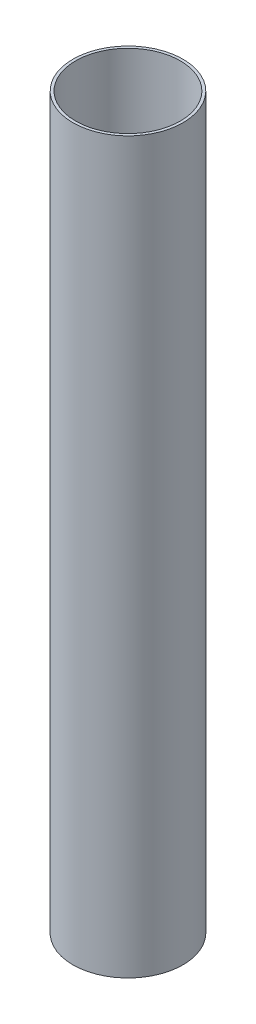
ISO-10303-21;
HEADER;
FILE_DESCRIPTION(('STEP AP214'),'2;1');
FILE_NAME('part.step','',(''),(''),'','','');
FILE_SCHEMA(('AUTOMOTIVE_DESIGN { 1 0 10303 214 1 1 1 1 }'));
ENDSEC;
DATA;
#1=APPLICATION_CONTEXT('core data for automotive mechanical design processes');
#2=APPLICATION_PROTOCOL_DEFINITION('international standard','automotive_design',2000,#1);
#3=PRODUCT_CONTEXT('',#1,'mechanical');
#4=PRODUCT('Part','Part','',(#3));
#5=PRODUCT_RELATED_PRODUCT_CATEGORY('part','',(#4));
#6=PRODUCT_DEFINITION_FORMATION('','',#4);
#7=PRODUCT_DEFINITION_CONTEXT('part definition',#1,'design');
#8=PRODUCT_DEFINITION('design','',#6,#7);
#9=PRODUCT_DEFINITION_SHAPE('','',#8);
#10=(LENGTH_UNIT() NAMED_UNIT(*) SI_UNIT(.MILLI.,.METRE.));
#11=(NAMED_UNIT(*) PLANE_ANGLE_UNIT() SI_UNIT($,.RADIAN.));
#12=(NAMED_UNIT(*) SI_UNIT($,.STERADIAN.) SOLID_ANGLE_UNIT());
#13=UNCERTAINTY_MEASURE_WITH_UNIT(LENGTH_MEASURE(1.E-05),#10,'distance_accuracy_value','');
#14=(GEOMETRIC_REPRESENTATION_CONTEXT(3) GLOBAL_UNCERTAINTY_ASSIGNED_CONTEXT((#13)) GLOBAL_UNIT_ASSIGNED_CONTEXT((#10,
#11,#12)) REPRESENTATION_CONTEXT('',''));
#15=CARTESIAN_POINT('',(0.,0.,0.));
#16=DIRECTION('',(0.,0.,1.));
#17=DIRECTION('',(1.,0.,0.));
#18=AXIS2_PLACEMENT_3D('',#15,#16,#17);
#19=CARTESIAN_POINT('',(0.,265.,0.));
#20=DIRECTION('',(0.,1.,0.));
#21=DIRECTION('',(0.,0.,1.));
#22=AXIS2_PLACEMENT_3D('',#19,#20,#21);
#23=PLANE('',#22);
#24=CARTESIAN_POINT('',(0.,265.,0.));
#25=DIRECTION('',(0.,1.,0.));
#26=DIRECTION('',(0.,0.,1.));
#27=AXIS2_PLACEMENT_3D('',#24,#25,#26);
#28=CIRCLE('',#27,20.);
#29=CARTESIAN_POINT('',(0.,265.,20.));
#30=VERTEX_POINT('',#29);
#31=EDGE_CURVE('E10',#30,#30,#28,.T.);
#32=ORIENTED_EDGE('',*,*,#31,.T.);
#33=EDGE_LOOP('',(#32));
#34=FACE_BOUND('',#33,.T.);
#35=CARTESIAN_POINT('',(0.,265.,0.));
#36=DIRECTION('',(0.,1.,0.));
#37=DIRECTION('',(0.,0.,1.));
#38=AXIS2_PLACEMENT_3D('',#35,#36,#37);
#39=CIRCLE('',#38,19.);
#40=CARTESIAN_POINT('',(0.,265.,19.));
#41=VERTEX_POINT('',#40);
#42=EDGE_CURVE('E43',#41,#41,#39,.T.);
#43=ORIENTED_EDGE('',*,*,#42,.F.);
#44=EDGE_LOOP('',(#43));
#45=FACE_BOUND('',#44,.T.);
#46=ADVANCED_FACE('F32',(#34,#45),#23,.T.);
#47=CARTESIAN_POINT('',(0.,0.,0.));
#48=DIRECTION('',(0.,1.,0.));
#49=DIRECTION('',(0.,0.,1.));
#50=AXIS2_PLACEMENT_3D('',#47,#48,#49);
#51=PLANE('',#50);
#52=CARTESIAN_POINT('',(0.,0.,0.));
#53=DIRECTION('',(0.,1.,0.));
#54=DIRECTION('',(0.,0.,1.));
#55=AXIS2_PLACEMENT_3D('',#52,#53,#54);
#56=CIRCLE('',#55,20.);
#57=CARTESIAN_POINT('',(0.,0.,20.));
#58=VERTEX_POINT('',#57);
#59=EDGE_CURVE('E36',#58,#58,#56,.T.);
#60=ORIENTED_EDGE('',*,*,#59,.F.);
#61=EDGE_LOOP('',(#60));
#62=FACE_BOUND('',#61,.T.);
#63=CARTESIAN_POINT('',(0.,0.,0.));
#64=DIRECTION('',(0.,1.,0.));
#65=DIRECTION('',(0.,0.,1.));
#66=AXIS2_PLACEMENT_3D('',#63,#64,#65);
#67=CIRCLE('',#66,19.);
#68=CARTESIAN_POINT('',(0.,0.,19.));
#69=VERTEX_POINT('',#68);
#70=EDGE_CURVE('E45',#69,#69,#67,.T.);
#71=ORIENTED_EDGE('',*,*,#70,.T.);
#72=EDGE_LOOP('',(#71));
#73=FACE_BOUND('',#72,.T.);
#74=ADVANCED_FACE('F55',(#62,#73),#51,.F.);
#75=CARTESIAN_POINT('',(0.,265.,0.));
#76=DIRECTION('',(0.,-1.,0.));
#77=DIRECTION('',(0.,0.,-1.));
#78=AXIS2_PLACEMENT_3D('',#75,#76,#77);
#79=CYLINDRICAL_SURFACE('',#78,20.);
#80=ORIENTED_EDGE('',*,*,#31,.F.);
#81=EDGE_LOOP('',(#80));
#82=FACE_BOUND('',#81,.T.);
#83=ORIENTED_EDGE('',*,*,#59,.T.);
#84=EDGE_LOOP('',(#83));
#85=FACE_BOUND('',#84,.T.);
#86=ADVANCED_FACE('F34',(#82,#85),#79,.T.);
#87=CARTESIAN_POINT('',(0.,265.,0.));
#88=DIRECTION('',(0.,-1.,0.));
#89=DIRECTION('',(0.,0.,-1.));
#90=AXIS2_PLACEMENT_3D('',#87,#88,#89);
#91=CYLINDRICAL_SURFACE('',#90,19.);
#92=ORIENTED_EDGE('',*,*,#42,.T.);
#93=EDGE_LOOP('',(#92));
#94=FACE_BOUND('',#93,.T.);
#95=ORIENTED_EDGE('',*,*,#70,.F.);
#96=EDGE_LOOP('',(#95));
#97=FACE_BOUND('',#96,.T.);
#98=ADVANCED_FACE('F51',(#94,#97),#91,.F.);
#99=CLOSED_SHELL('',(#46,#74,#86,#98));
#100=MANIFOLD_SOLID_BREP('B2',#99);
#101=ADVANCED_BREP_SHAPE_REPRESENTATION('',(#18,#100),#14);
#102=SHAPE_DEFINITION_REPRESENTATION(#9,#101);
ENDSEC;
END-ISO-10303-21;
